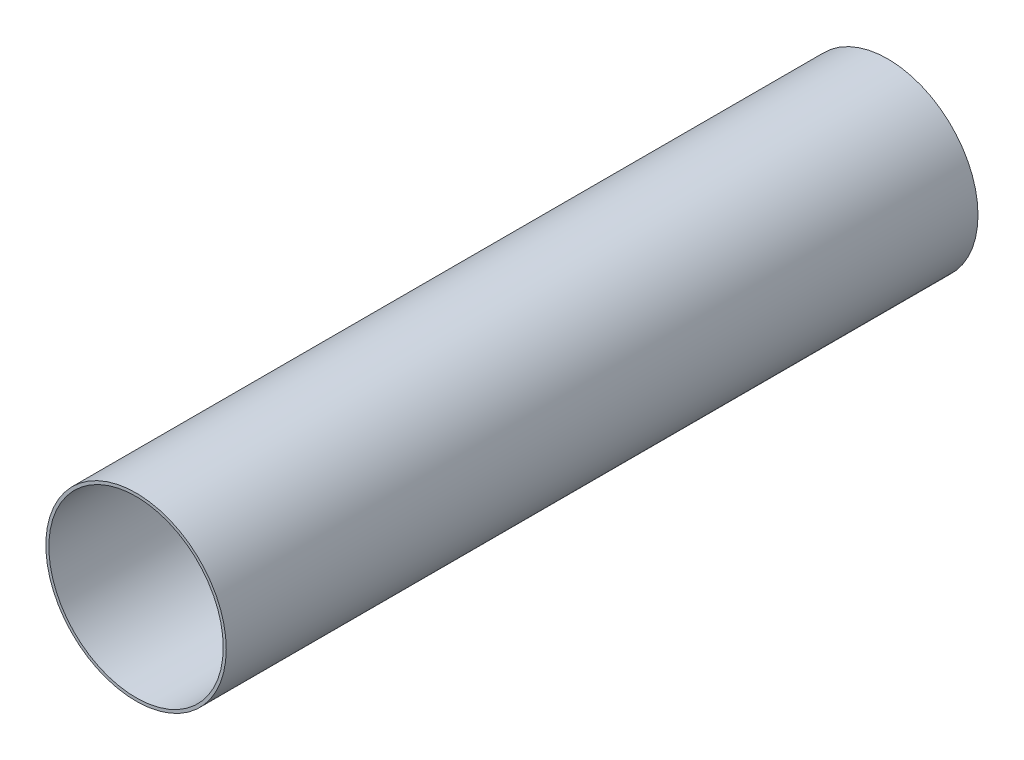
ISO-10303-21;
HEADER;
FILE_DESCRIPTION(('STEP AP214'),'2;1');
FILE_NAME('part.step','',(''),(''),'','','');
FILE_SCHEMA(('AUTOMOTIVE_DESIGN { 1 0 10303 214 1 1 1 1 }'));
ENDSEC;
DATA;
#1=APPLICATION_CONTEXT('core data for automotive mechanical design processes');
#2=APPLICATION_PROTOCOL_DEFINITION('international standard','automotive_design',2000,#1);
#3=PRODUCT_CONTEXT('',#1,'mechanical');
#4=PRODUCT('Part','Part','',(#3));
#5=PRODUCT_RELATED_PRODUCT_CATEGORY('part','',(#4));
#6=PRODUCT_DEFINITION_FORMATION('','',#4);
#7=PRODUCT_DEFINITION_CONTEXT('part definition',#1,'design');
#8=PRODUCT_DEFINITION('design','',#6,#7);
#9=PRODUCT_DEFINITION_SHAPE('','',#8);
#10=(LENGTH_UNIT() NAMED_UNIT(*) SI_UNIT(.MILLI.,.METRE.));
#11=(NAMED_UNIT(*) PLANE_ANGLE_UNIT() SI_UNIT($,.RADIAN.));
#12=(NAMED_UNIT(*) SI_UNIT($,.STERADIAN.) SOLID_ANGLE_UNIT());
#13=UNCERTAINTY_MEASURE_WITH_UNIT(LENGTH_MEASURE(1.E-05),#10,'distance_accuracy_value','');
#14=(GEOMETRIC_REPRESENTATION_CONTEXT(3) GLOBAL_UNCERTAINTY_ASSIGNED_CONTEXT((#13)) GLOBAL_UNIT_ASSIGNED_CONTEXT((#10,
#11,#12)) REPRESENTATION_CONTEXT('',''));
#15=CARTESIAN_POINT('',(0.,0.,0.));
#16=DIRECTION('',(0.,0.,1.));
#17=DIRECTION('',(1.,0.,0.));
#18=AXIS2_PLACEMENT_3D('',#15,#16,#17);
#19=CARTESIAN_POINT('',(0.,0.,250.));
#20=DIRECTION('',(0.,0.,1.));
#21=DIRECTION('',(1.,0.,0.));
#22=AXIS2_PLACEMENT_3D('',#19,#20,#21);
#23=PLANE('',#22);
#24=CARTESIAN_POINT('',(0.,0.,250.));
#25=DIRECTION('',(0.,0.,1.));
#26=DIRECTION('',(1.,0.,0.));
#27=AXIS2_PLACEMENT_3D('',#24,#25,#26);
#28=CIRCLE('',#27,30.);
#29=CARTESIAN_POINT('',(30.,0.,250.));
#30=VERTEX_POINT('',#29);
#31=EDGE_CURVE('E10',#30,#30,#28,.T.);
#32=ORIENTED_EDGE('',*,*,#31,.T.);
#33=EDGE_LOOP('',(#32));
#34=FACE_BOUND('',#33,.T.);
#35=CARTESIAN_POINT('',(0.,0.,250.));
#36=DIRECTION('',(0.,0.,1.));
#37=DIRECTION('',(1.,0.,0.));
#38=AXIS2_PLACEMENT_3D('',#35,#36,#37);
#39=CIRCLE('',#38,29.);
#40=CARTESIAN_POINT('',(29.,0.,250.));
#41=VERTEX_POINT('',#40);
#42=EDGE_CURVE('E50',#41,#41,#39,.T.);
#43=ORIENTED_EDGE('',*,*,#42,.F.);
#44=EDGE_LOOP('',(#43));
#45=FACE_BOUND('',#44,.T.);
#46=ADVANCED_FACE('F37',(#34,#45),#23,.T.);
#47=CARTESIAN_POINT('',(0.,0.,0.));
#48=DIRECTION('',(0.,0.,1.));
#49=DIRECTION('',(1.,0.,0.));
#50=AXIS2_PLACEMENT_3D('',#47,#48,#49);
#51=PLANE('',#50);
#52=CARTESIAN_POINT('',(0.,0.,0.));
#53=DIRECTION('',(0.,0.,1.));
#54=DIRECTION('',(1.,0.,0.));
#55=AXIS2_PLACEMENT_3D('',#52,#53,#54);
#56=CIRCLE('',#55,30.);
#57=CARTESIAN_POINT('',(30.,0.,0.));
#58=VERTEX_POINT('',#57);
#59=EDGE_CURVE('E41',#58,#58,#56,.T.);
#60=ORIENTED_EDGE('',*,*,#59,.F.);
#61=EDGE_LOOP('',(#60));
#62=FACE_BOUND('',#61,.T.);
#63=CARTESIAN_POINT('',(0.,0.,0.));
#64=DIRECTION('',(0.,0.,1.));
#65=DIRECTION('',(1.,0.,0.));
#66=AXIS2_PLACEMENT_3D('',#63,#64,#65);
#67=CIRCLE('',#66,29.);
#68=CARTESIAN_POINT('',(29.,0.,0.));
#69=VERTEX_POINT('',#68);
#70=EDGE_CURVE('E52',#69,#69,#67,.T.);
#71=ORIENTED_EDGE('',*,*,#70,.T.);
#72=EDGE_LOOP('',(#71));
#73=FACE_BOUND('',#72,.T.);
#74=ADVANCED_FACE('F64',(#62,#73),#51,.F.);
#75=CARTESIAN_POINT('',(0.,0.,250.));
#76=DIRECTION('',(0.,0.,-1.));
#77=DIRECTION('',(-1.,0.,0.));
#78=AXIS2_PLACEMENT_3D('',#75,#76,#77);
#79=CYLINDRICAL_SURFACE('',#78,30.);
#80=ORIENTED_EDGE('',*,*,#31,.F.);
#81=EDGE_LOOP('',(#80));
#82=FACE_BOUND('',#81,.T.);
#83=ORIENTED_EDGE('',*,*,#59,.T.);
#84=EDGE_LOOP('',(#83));
#85=FACE_BOUND('',#84,.T.);
#86=ADVANCED_FACE('F39',(#82,#85),#79,.T.);
#87=CARTESIAN_POINT('',(0.,0.,250.));
#88=DIRECTION('',(0.,0.,-1.));
#89=DIRECTION('',(-1.,0.,0.));
#90=AXIS2_PLACEMENT_3D('',#87,#88,#89);
#91=CYLINDRICAL_SURFACE('',#90,29.);
#92=ORIENTED_EDGE('',*,*,#42,.T.);
#93=EDGE_LOOP('',(#92));
#94=FACE_BOUND('',#93,.T.);
#95=ORIENTED_EDGE('',*,*,#70,.F.);
#96=EDGE_LOOP('',(#95));
#97=FACE_BOUND('',#96,.T.);
#98=ADVANCED_FACE('F60',(#94,#97),#91,.F.);
#99=CLOSED_SHELL('',(#46,#74,#86,#98));
#100=MANIFOLD_SOLID_BREP('B2',#99);
#101=ADVANCED_BREP_SHAPE_REPRESENTATION('',(#18,#100),#14);
#102=SHAPE_DEFINITION_REPRESENTATION(#9,#101);
ENDSEC;
END-ISO-10303-21;
